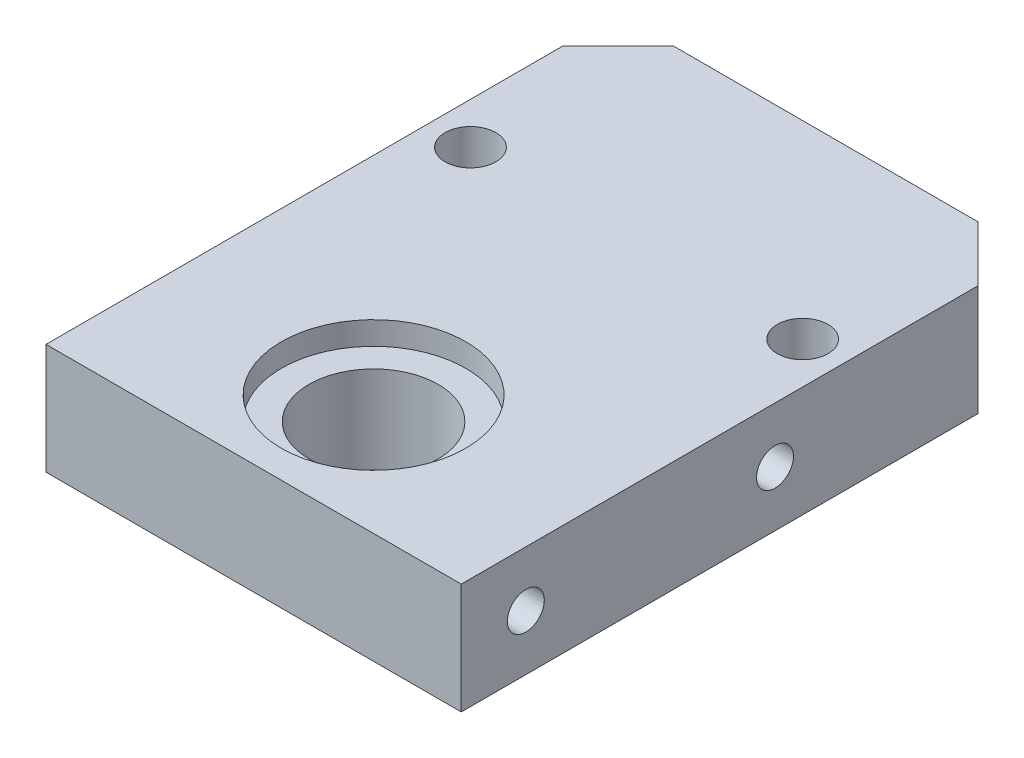
ISO-10303-21;
HEADER;
FILE_DESCRIPTION(('STEP AP214'),'2;1');
FILE_NAME('part.step','',(''),(''),'','','');
FILE_SCHEMA(('AUTOMOTIVE_DESIGN { 1 0 10303 214 1 1 1 1 }'));
ENDSEC;
DATA;
#1=APPLICATION_CONTEXT('core data for automotive mechanical design processes');
#2=APPLICATION_PROTOCOL_DEFINITION('international standard','automotive_design',2000,#1);
#3=PRODUCT_CONTEXT('',#1,'mechanical');
#4=PRODUCT('Part','Part','',(#3));
#5=PRODUCT_RELATED_PRODUCT_CATEGORY('part','',(#4));
#6=PRODUCT_DEFINITION_FORMATION('','',#4);
#7=PRODUCT_DEFINITION_CONTEXT('part definition',#1,'design');
#8=PRODUCT_DEFINITION('design','',#6,#7);
#9=PRODUCT_DEFINITION_SHAPE('','',#8);
#10=(LENGTH_UNIT() NAMED_UNIT(*) SI_UNIT(.MILLI.,.METRE.));
#11=(NAMED_UNIT(*) PLANE_ANGLE_UNIT() SI_UNIT($,.RADIAN.));
#12=(NAMED_UNIT(*) SI_UNIT($,.STERADIAN.) SOLID_ANGLE_UNIT());
#13=UNCERTAINTY_MEASURE_WITH_UNIT(LENGTH_MEASURE(1.E-05),#10,'distance_accuracy_value','');
#14=(GEOMETRIC_REPRESENTATION_CONTEXT(3) GLOBAL_UNCERTAINTY_ASSIGNED_CONTEXT((#13)) GLOBAL_UNIT_ASSIGNED_CONTEXT((#10,
#11,#12)) REPRESENTATION_CONTEXT('',''));
#15=CARTESIAN_POINT('',(0.,0.,0.));
#16=DIRECTION('',(0.,0.,1.));
#17=DIRECTION('',(1.,0.,0.));
#18=AXIS2_PLACEMENT_3D('',#15,#16,#17);
#19=CARTESIAN_POINT('',(0.,0.,18.));
#20=DIRECTION('',(0.,1.,0.));
#21=DIRECTION('',(0.,0.,1.));
#22=AXIS2_PLACEMENT_3D('',#19,#20,#21);
#23=CYLINDRICAL_SURFACE('',#22,7.);
#24=CARTESIAN_POINT('',(0.,0.,18.));
#25=DIRECTION('',(0.,1.,0.));
#26=DIRECTION('',(0.,0.,1.));
#27=AXIS2_PLACEMENT_3D('',#24,#25,#26);
#28=CIRCLE('',#27,7.);
#29=CARTESIAN_POINT('',(0.,0.,25.));
#30=VERTEX_POINT('',#29);
#31=EDGE_CURVE('E117',#30,#30,#28,.T.);
#32=ORIENTED_EDGE('',*,*,#31,.F.);
#33=EDGE_LOOP('',(#32));
#34=FACE_BOUND('',#33,.T.);
#35=CARTESIAN_POINT('',(0.,9.5,18.));
#36=DIRECTION('',(0.,1.,0.));
#37=DIRECTION('',(0.,0.,1.));
#38=AXIS2_PLACEMENT_3D('',#35,#36,#37);
#39=CIRCLE('',#38,7.);
#40=CARTESIAN_POINT('',(0.,9.5,25.));
#41=VERTEX_POINT('',#40);
#42=EDGE_CURVE('E123',#41,#41,#39,.F.);
#43=ORIENTED_EDGE('',*,*,#42,.F.);
#44=EDGE_LOOP('',(#43));
#45=FACE_BOUND('',#44,.T.);
#46=ADVANCED_FACE('F32',(#34,#45),#23,.F.);
#47=CARTESIAN_POINT('',(22.5,12.,-31.));
#48=DIRECTION('',(-1.,0.,0.));
#49=DIRECTION('',(0.,0.,1.));
#50=AXIS2_PLACEMENT_3D('',#47,#48,#49);
#51=PLANE('',#50);
#52=CARTESIAN_POINT('',(22.5,6.,24.));
#53=DIRECTION('',(1.,0.,0.));
#54=DIRECTION('',(0.,0.,-1.));
#55=AXIS2_PLACEMENT_3D('',#52,#53,#54);
#56=CIRCLE('',#55,2.);
#57=CARTESIAN_POINT('',(22.5,6.,22.));
#58=VERTEX_POINT('',#57);
#59=EDGE_CURVE('E186',#58,#58,#56,.T.);
#60=ORIENTED_EDGE('',*,*,#59,.F.);
#61=EDGE_LOOP('',(#60));
#62=FACE_BOUND('',#61,.T.);
#63=CARTESIAN_POINT('',(22.5,6.,-2.99999999999999));
#64=DIRECTION('',(1.,0.,0.));
#65=DIRECTION('',(0.,0.,-1.));
#66=AXIS2_PLACEMENT_3D('',#63,#64,#65);
#67=CIRCLE('',#66,2.);
#68=CARTESIAN_POINT('',(22.5,6.,-5.));
#69=VERTEX_POINT('',#68);
#70=EDGE_CURVE('E180',#69,#69,#67,.T.);
#71=ORIENTED_EDGE('',*,*,#70,.F.);
#72=EDGE_LOOP('',(#71));
#73=FACE_BOUND('',#72,.T.);
#74=DIRECTION('',(0.,0.,-1.));
#75=VECTOR('',#74,1.);
#76=CARTESIAN_POINT('',(22.5,0.,-31.));
#77=LINE('',#76,#75);
#78=CARTESIAN_POINT('',(22.5,0.,31.));
#79=VERTEX_POINT('',#78);
#80=CARTESIAN_POINT('',(22.5,0.,-25.));
#81=VERTEX_POINT('',#80);
#82=EDGE_CURVE('E114',#79,#81,#77,.T.);
#83=ORIENTED_EDGE('',*,*,#82,.T.);
#84=DIRECTION('',(0.,1.,0.));
#85=VECTOR('',#84,1.);
#86=CARTESIAN_POINT('',(22.5,12.,-25.));
#87=LINE('',#86,#85);
#88=CARTESIAN_POINT('',(22.5,12.,-25.));
#89=VERTEX_POINT('',#88);
#90=EDGE_CURVE('E11',#81,#89,#87,.T.);
#91=ORIENTED_EDGE('',*,*,#90,.T.);
#92=DIRECTION('',(0.,0.,-1.));
#93=VECTOR('',#92,1.);
#94=CARTESIAN_POINT('',(22.5,12.,-31.));
#95=LINE('',#94,#93);
#96=CARTESIAN_POINT('',(22.5,12.,31.));
#97=VERTEX_POINT('',#96);
#98=EDGE_CURVE('E121',#97,#89,#95,.T.);
#99=ORIENTED_EDGE('',*,*,#98,.F.);
#100=DIRECTION('',(0.,-1.,0.));
#101=VECTOR('',#100,1.);
#102=CARTESIAN_POINT('',(22.5,12.,31.));
#103=LINE('',#102,#101);
#104=EDGE_CURVE('E106',#97,#79,#103,.T.);
#105=ORIENTED_EDGE('',*,*,#104,.T.);
#106=EDGE_LOOP('',(#83,#91,#99,#105));
#107=FACE_BOUND('',#106,.T.);
#108=ADVANCED_FACE('F146',(#62,#73,#107),#51,.F.);
#109=CARTESIAN_POINT('',(-22.5,12.,-31.));
#110=DIRECTION('',(0.,0.,1.));
#111=DIRECTION('',(1.,0.,0.));
#112=AXIS2_PLACEMENT_3D('',#109,#110,#111);
#113=PLANE('',#112);
#114=DIRECTION('',(-1.,0.,0.));
#115=VECTOR('',#114,1.);
#116=CARTESIAN_POINT('',(-22.5,0.,-31.));
#117=LINE('',#116,#115);
#118=CARTESIAN_POINT('',(16.5,0.,-31.));
#119=VERTEX_POINT('',#118);
#120=CARTESIAN_POINT('',(-16.5,0.,-31.));
#121=VERTEX_POINT('',#120);
#122=EDGE_CURVE('E116',#119,#121,#117,.T.);
#123=ORIENTED_EDGE('',*,*,#122,.T.);
#124=DIRECTION('',(0.,1.,0.));
#125=VECTOR('',#124,1.);
#126=CARTESIAN_POINT('',(-16.5,12.,-31.));
#127=LINE('',#126,#125);
#128=CARTESIAN_POINT('',(-16.5,12.,-31.));
#129=VERTEX_POINT('',#128);
#130=EDGE_CURVE('E53',#121,#129,#127,.T.);
#131=ORIENTED_EDGE('',*,*,#130,.T.);
#132=DIRECTION('',(-1.,0.,0.));
#133=VECTOR('',#132,1.);
#134=CARTESIAN_POINT('',(-22.5,12.,-31.));
#135=LINE('',#134,#133);
#136=CARTESIAN_POINT('',(16.5,12.,-31.));
#137=VERTEX_POINT('',#136);
#138=EDGE_CURVE('E96',#137,#129,#135,.T.);
#139=ORIENTED_EDGE('',*,*,#138,.F.);
#140=DIRECTION('',(0.,-1.,0.));
#141=VECTOR('',#140,1.);
#142=CARTESIAN_POINT('',(16.5,12.,-31.));
#143=LINE('',#142,#141);
#144=EDGE_CURVE('E133',#137,#119,#143,.T.);
#145=ORIENTED_EDGE('',*,*,#144,.T.);
#146=EDGE_LOOP('',(#123,#131,#139,#145));
#147=FACE_BOUND('',#146,.T.);
#148=ADVANCED_FACE('F141',(#147),#113,.F.);
#149=CARTESIAN_POINT('',(-22.5,12.,-31.));
#150=DIRECTION('',(1.,0.,0.));
#151=DIRECTION('',(0.,0.,-1.));
#152=AXIS2_PLACEMENT_3D('',#149,#150,#151);
#153=PLANE('',#152);
#154=CARTESIAN_POINT('',(-22.5,6.,24.));
#155=DIRECTION('',(-1.,0.,0.));
#156=DIRECTION('',(0.,0.,1.));
#157=AXIS2_PLACEMENT_3D('',#154,#155,#156);
#158=CIRCLE('',#157,2.);
#159=CARTESIAN_POINT('',(-22.5,6.,26.));
#160=VERTEX_POINT('',#159);
#161=EDGE_CURVE('E175',#160,#160,#158,.T.);
#162=ORIENTED_EDGE('',*,*,#161,.F.);
#163=EDGE_LOOP('',(#162));
#164=FACE_BOUND('',#163,.T.);
#165=CARTESIAN_POINT('',(-22.5,6.,-3.));
#166=DIRECTION('',(-1.,0.,0.));
#167=DIRECTION('',(0.,0.,1.));
#168=AXIS2_PLACEMENT_3D('',#165,#166,#167);
#169=CIRCLE('',#168,2.);
#170=CARTESIAN_POINT('',(-22.5,6.,-0.999999999999997));
#171=VERTEX_POINT('',#170);
#172=EDGE_CURVE('E168',#171,#171,#169,.T.);
#173=ORIENTED_EDGE('',*,*,#172,.F.);
#174=EDGE_LOOP('',(#173));
#175=FACE_BOUND('',#174,.T.);
#176=DIRECTION('',(0.,0.,1.));
#177=VECTOR('',#176,1.);
#178=CARTESIAN_POINT('',(-22.5,12.,-31.));
#179=LINE('',#178,#177);
#180=CARTESIAN_POINT('',(-22.5,12.,-25.));
#181=VERTEX_POINT('',#180);
#182=CARTESIAN_POINT('',(-22.5,12.,31.));
#183=VERTEX_POINT('',#182);
#184=EDGE_CURVE('E86',#181,#183,#179,.T.);
#185=ORIENTED_EDGE('',*,*,#184,.F.);
#186=DIRECTION('',(0.,-1.,0.));
#187=VECTOR('',#186,1.);
#188=CARTESIAN_POINT('',(-22.5,12.,-25.));
#189=LINE('',#188,#187);
#190=CARTESIAN_POINT('',(-22.5,0.,-25.));
#191=VERTEX_POINT('',#190);
#192=EDGE_CURVE('E105',#181,#191,#189,.T.);
#193=ORIENTED_EDGE('',*,*,#192,.T.);
#194=DIRECTION('',(0.,0.,1.));
#195=VECTOR('',#194,1.);
#196=CARTESIAN_POINT('',(-22.5,0.,-31.));
#197=LINE('',#196,#195);
#198=CARTESIAN_POINT('',(-22.5,0.,31.));
#199=VERTEX_POINT('',#198);
#200=EDGE_CURVE('E102',#191,#199,#197,.T.);
#201=ORIENTED_EDGE('',*,*,#200,.T.);
#202=DIRECTION('',(0.,-1.,0.));
#203=VECTOR('',#202,1.);
#204=CARTESIAN_POINT('',(-22.5,12.,31.));
#205=LINE('',#204,#203);
#206=EDGE_CURVE('E99',#183,#199,#205,.T.);
#207=ORIENTED_EDGE('',*,*,#206,.F.);
#208=EDGE_LOOP('',(#185,#193,#201,#207));
#209=FACE_BOUND('',#208,.T.);
#210=ADVANCED_FACE('F100',(#164,#175,#209),#153,.F.);
#211=CARTESIAN_POINT('',(-22.5,12.,31.));
#212=DIRECTION('',(0.,0.,-1.));
#213=DIRECTION('',(-1.,0.,0.));
#214=AXIS2_PLACEMENT_3D('',#211,#212,#213);
#215=PLANE('',#214);
#216=DIRECTION('',(1.,0.,0.));
#217=VECTOR('',#216,1.);
#218=CARTESIAN_POINT('',(-22.5,0.,31.));
#219=LINE('',#218,#217);
#220=EDGE_CURVE('E120',#199,#79,#219,.T.);
#221=ORIENTED_EDGE('',*,*,#220,.T.);
#222=ORIENTED_EDGE('',*,*,#104,.F.);
#223=DIRECTION('',(1.,0.,0.));
#224=VECTOR('',#223,1.);
#225=CARTESIAN_POINT('',(-22.5,12.,31.));
#226=LINE('',#225,#224);
#227=EDGE_CURVE('E90',#183,#97,#226,.T.);
#228=ORIENTED_EDGE('',*,*,#227,.F.);
#229=ORIENTED_EDGE('',*,*,#206,.T.);
#230=EDGE_LOOP('',(#221,#222,#228,#229));
#231=FACE_BOUND('',#230,.T.);
#232=ADVANCED_FACE('F108',(#231),#215,.F.);
#233=CARTESIAN_POINT('',(0.,12.,0.));
#234=DIRECTION('',(0.,1.,0.));
#235=DIRECTION('',(0.,0.,1.));
#236=AXIS2_PLACEMENT_3D('',#233,#234,#235);
#237=PLANE('',#236);
#238=CARTESIAN_POINT('',(0.,12.,18.));
#239=DIRECTION('',(0.,1.,0.));
#240=DIRECTION('',(0.,0.,1.));
#241=AXIS2_PLACEMENT_3D('',#238,#239,#240);
#242=CIRCLE('',#241,10.);
#243=CARTESIAN_POINT('',(0.,12.,28.));
#244=VERTEX_POINT('',#243);
#245=EDGE_CURVE('E162',#244,#244,#242,.T.);
#246=ORIENTED_EDGE('',*,*,#245,.F.);
#247=EDGE_LOOP('',(#246));
#248=FACE_BOUND('',#247,.T.);
#249=CARTESIAN_POINT('',(-18.,12.,-10.5));
#250=DIRECTION('',(0.,1.,0.));
#251=DIRECTION('',(0.,0.,1.));
#252=AXIS2_PLACEMENT_3D('',#249,#250,#251);
#253=CIRCLE('',#252,2.75);
#254=CARTESIAN_POINT('',(-18.,12.,-7.75));
#255=VERTEX_POINT('',#254);
#256=EDGE_CURVE('E154',#255,#255,#253,.T.);
#257=ORIENTED_EDGE('',*,*,#256,.F.);
#258=EDGE_LOOP('',(#257));
#259=FACE_BOUND('',#258,.T.);
#260=CARTESIAN_POINT('',(18.,12.,-10.5));
#261=DIRECTION('',(0.,1.,0.));
#262=DIRECTION('',(0.,0.,1.));
#263=AXIS2_PLACEMENT_3D('',#260,#261,#262);
#264=CIRCLE('',#263,2.75);
#265=CARTESIAN_POINT('',(18.,12.,-7.75));
#266=VERTEX_POINT('',#265);
#267=EDGE_CURVE('E126',#266,#266,#264,.T.);
#268=ORIENTED_EDGE('',*,*,#267,.F.);
#269=EDGE_LOOP('',(#268));
#270=FACE_BOUND('',#269,.T.);
#271=ORIENTED_EDGE('',*,*,#138,.T.);
#272=DIRECTION('',(0.707106781186549,0.,-0.707106781186546));
#273=VECTOR('',#272,1.);
#274=CARTESIAN_POINT('',(-23.75,12.,-23.7500000000001));
#275=LINE('',#274,#273);
#276=EDGE_CURVE('E40',#129,#181,#275,.F.);
#277=ORIENTED_EDGE('',*,*,#276,.T.);
#278=ORIENTED_EDGE('',*,*,#184,.T.);
#279=ORIENTED_EDGE('',*,*,#227,.T.);
#280=ORIENTED_EDGE('',*,*,#98,.T.);
#281=DIRECTION('',(0.707106781186546,0.,0.707106781186549));
#282=VECTOR('',#281,1.);
#283=CARTESIAN_POINT('',(23.75,12.,-23.7499999999999));
#284=LINE('',#283,#282);
#285=EDGE_CURVE('E137',#89,#137,#284,.F.);
#286=ORIENTED_EDGE('',*,*,#285,.T.);
#287=EDGE_LOOP('',(#271,#277,#278,#279,#280,#286));
#288=FACE_BOUND('',#287,.T.);
#289=ADVANCED_FACE('F88',(#248,#259,#270,#288),#237,.T.);
#290=CARTESIAN_POINT('',(0.,0.,0.));
#291=DIRECTION('',(0.,1.,0.));
#292=DIRECTION('',(0.,0.,1.));
#293=AXIS2_PLACEMENT_3D('',#290,#291,#292);
#294=PLANE('',#293);
#295=ORIENTED_EDGE('',*,*,#31,.T.);
#296=EDGE_LOOP('',(#295));
#297=FACE_BOUND('',#296,.T.);
#298=CARTESIAN_POINT('',(-18.,0.,-10.5));
#299=DIRECTION('',(0.,1.,0.));
#300=DIRECTION('',(0.,0.,1.));
#301=AXIS2_PLACEMENT_3D('',#298,#299,#300);
#302=CIRCLE('',#301,2.75);
#303=CARTESIAN_POINT('',(-18.,0.,-7.75));
#304=VERTEX_POINT('',#303);
#305=EDGE_CURVE('E157',#304,#304,#302,.T.);
#306=ORIENTED_EDGE('',*,*,#305,.T.);
#307=EDGE_LOOP('',(#306));
#308=FACE_BOUND('',#307,.T.);
#309=CARTESIAN_POINT('',(18.,0.,-10.5));
#310=DIRECTION('',(0.,1.,0.));
#311=DIRECTION('',(0.,0.,1.));
#312=AXIS2_PLACEMENT_3D('',#309,#310,#311);
#313=CIRCLE('',#312,2.75);
#314=CARTESIAN_POINT('',(18.,0.,-7.75));
#315=VERTEX_POINT('',#314);
#316=EDGE_CURVE('E151',#315,#315,#313,.T.);
#317=ORIENTED_EDGE('',*,*,#316,.T.);
#318=EDGE_LOOP('',(#317));
#319=FACE_BOUND('',#318,.T.);
#320=ORIENTED_EDGE('',*,*,#200,.F.);
#321=DIRECTION('',(-0.707106781186549,0.,0.707106781186546));
#322=VECTOR('',#321,1.);
#323=CARTESIAN_POINT('',(-22.5,0.,-25.));
#324=LINE('',#323,#322);
#325=EDGE_CURVE('E131',#191,#121,#324,.F.);
#326=ORIENTED_EDGE('',*,*,#325,.T.);
#327=ORIENTED_EDGE('',*,*,#122,.F.);
#328=DIRECTION('',(-0.707106781186546,0.,-0.707106781186549));
#329=VECTOR('',#328,1.);
#330=CARTESIAN_POINT('',(16.5,0.,-31.));
#331=LINE('',#330,#329);
#332=EDGE_CURVE('E129',#119,#81,#331,.F.);
#333=ORIENTED_EDGE('',*,*,#332,.T.);
#334=ORIENTED_EDGE('',*,*,#82,.F.);
#335=ORIENTED_EDGE('',*,*,#220,.F.);
#336=EDGE_LOOP('',(#320,#326,#327,#333,#334,#335));
#337=FACE_BOUND('',#336,.T.);
#338=ADVANCED_FACE('F145',(#297,#308,#319,#337),#294,.F.);
#339=CARTESIAN_POINT('',(18.,0.,-10.5));
#340=DIRECTION('',(0.,1.,0.));
#341=DIRECTION('',(0.,0.,1.));
#342=AXIS2_PLACEMENT_3D('',#339,#340,#341);
#343=CYLINDRICAL_SURFACE('',#342,2.75);
#344=ORIENTED_EDGE('',*,*,#316,.F.);
#345=EDGE_LOOP('',(#344));
#346=FACE_BOUND('',#345,.T.);
#347=ORIENTED_EDGE('',*,*,#267,.T.);
#348=EDGE_LOOP('',(#347));
#349=FACE_BOUND('',#348,.T.);
#350=ADVANCED_FACE('F236',(#346,#349),#343,.F.);
#351=CARTESIAN_POINT('',(-18.,0.,-10.5));
#352=DIRECTION('',(0.,1.,0.));
#353=DIRECTION('',(0.,0.,1.));
#354=AXIS2_PLACEMENT_3D('',#351,#352,#353);
#355=CYLINDRICAL_SURFACE('',#354,2.75);
#356=ORIENTED_EDGE('',*,*,#305,.F.);
#357=EDGE_LOOP('',(#356));
#358=FACE_BOUND('',#357,.T.);
#359=ORIENTED_EDGE('',*,*,#256,.T.);
#360=EDGE_LOOP('',(#359));
#361=FACE_BOUND('',#360,.T.);
#362=ADVANCED_FACE('F232',(#358,#361),#355,.F.);
#363=CARTESIAN_POINT('',(0.,9.5,18.));
#364=DIRECTION('',(0.,1.,0.));
#365=DIRECTION('',(0.,0.,1.));
#366=AXIS2_PLACEMENT_3D('',#363,#364,#365);
#367=PLANE('',#366);
#368=CARTESIAN_POINT('',(0.,9.5,18.));
#369=DIRECTION('',(0.,1.,0.));
#370=DIRECTION('',(0.,0.,1.));
#371=AXIS2_PLACEMENT_3D('',#368,#369,#370);
#372=CIRCLE('',#371,10.);
#373=CARTESIAN_POINT('',(0.,9.5,28.));
#374=VERTEX_POINT('',#373);
#375=EDGE_CURVE('E127',#374,#374,#372,.T.);
#376=ORIENTED_EDGE('',*,*,#375,.T.);
#377=EDGE_LOOP('',(#376));
#378=FACE_BOUND('',#377,.T.);
#379=ORIENTED_EDGE('',*,*,#42,.T.);
#380=EDGE_LOOP('',(#379));
#381=FACE_BOUND('',#380,.T.);
#382=ADVANCED_FACE('F235',(#378,#381),#367,.T.);
#383=CARTESIAN_POINT('',(0.,9.5,18.));
#384=DIRECTION('',(0.,1.,0.));
#385=DIRECTION('',(0.,0.,1.));
#386=AXIS2_PLACEMENT_3D('',#383,#384,#385);
#387=CYLINDRICAL_SURFACE('',#386,10.);
#388=ORIENTED_EDGE('',*,*,#375,.F.);
#389=EDGE_LOOP('',(#388));
#390=FACE_BOUND('',#389,.T.);
#391=ORIENTED_EDGE('',*,*,#245,.T.);
#392=EDGE_LOOP('',(#391));
#393=FACE_BOUND('',#392,.T.);
#394=ADVANCED_FACE('F230',(#390,#393),#387,.F.);
#395=CARTESIAN_POINT('',(-6.50000000000001,6.,-3.));
#396=DIRECTION('',(-1.,0.,0.));
#397=DIRECTION('',(0.,0.,1.));
#398=AXIS2_PLACEMENT_3D('',#395,#396,#397);
#399=CYLINDRICAL_SURFACE('',#398,2.);
#400=CARTESIAN_POINT('',(-6.50000000000001,6.,-3.));
#401=DIRECTION('',(-1.,0.,0.));
#402=DIRECTION('',(0.,0.,1.));
#403=AXIS2_PLACEMENT_3D('',#400,#401,#402);
#404=CIRCLE('',#403,2.);
#405=CARTESIAN_POINT('',(-6.50000000000001,6.,-0.999999999999999));
#406=VERTEX_POINT('',#405);
#407=EDGE_CURVE('E171',#406,#406,#404,.T.);
#408=ORIENTED_EDGE('',*,*,#407,.F.);
#409=EDGE_LOOP('',(#408));
#410=FACE_BOUND('',#409,.T.);
#411=ORIENTED_EDGE('',*,*,#172,.T.);
#412=EDGE_LOOP('',(#411));
#413=FACE_BOUND('',#412,.T.);
#414=ADVANCED_FACE('F301',(#410,#413),#399,.F.);
#415=CARTESIAN_POINT('',(-6.50000000000001,6.,-3.));
#416=DIRECTION('',(-1.,0.,0.));
#417=DIRECTION('',(0.,0.,1.));
#418=AXIS2_PLACEMENT_3D('',#415,#416,#417);
#419=PLANE('',#418);
#420=ORIENTED_EDGE('',*,*,#407,.T.);
#421=EDGE_LOOP('',(#420));
#422=FACE_BOUND('',#421,.T.);
#423=ADVANCED_FACE('F291',(#422),#419,.T.);
#424=CARTESIAN_POINT('',(-6.5,6.,24.));
#425=DIRECTION('',(-1.,0.,0.));
#426=DIRECTION('',(0.,0.,1.));
#427=AXIS2_PLACEMENT_3D('',#424,#425,#426);
#428=CYLINDRICAL_SURFACE('',#427,2.);
#429=CARTESIAN_POINT('',(-6.5,6.,24.));
#430=DIRECTION('',(-1.,0.,0.));
#431=DIRECTION('',(0.,0.,1.));
#432=AXIS2_PLACEMENT_3D('',#429,#430,#431);
#433=CIRCLE('',#432,2.);
#434=CARTESIAN_POINT('',(-6.5,6.,26.));
#435=VERTEX_POINT('',#434);
#436=EDGE_CURVE('E165',#435,#435,#433,.T.);
#437=ORIENTED_EDGE('',*,*,#436,.F.);
#438=EDGE_LOOP('',(#437));
#439=FACE_BOUND('',#438,.T.);
#440=ORIENTED_EDGE('',*,*,#161,.T.);
#441=EDGE_LOOP('',(#440));
#442=FACE_BOUND('',#441,.T.);
#443=ADVANCED_FACE('F217',(#439,#442),#428,.F.);
#444=CARTESIAN_POINT('',(-6.5,6.,24.));
#445=DIRECTION('',(-1.,0.,0.));
#446=DIRECTION('',(0.,0.,1.));
#447=AXIS2_PLACEMENT_3D('',#444,#445,#446);
#448=PLANE('',#447);
#449=ORIENTED_EDGE('',*,*,#436,.T.);
#450=EDGE_LOOP('',(#449));
#451=FACE_BOUND('',#450,.T.);
#452=ADVANCED_FACE('F208',(#451),#448,.T.);
#453=CARTESIAN_POINT('',(6.49999999999999,6.,-2.99999999999999));
#454=DIRECTION('',(1.,0.,0.));
#455=DIRECTION('',(0.,0.,-1.));
#456=AXIS2_PLACEMENT_3D('',#453,#454,#455);
#457=CYLINDRICAL_SURFACE('',#456,2.);
#458=CARTESIAN_POINT('',(6.49999999999999,6.,-2.99999999999999));
#459=DIRECTION('',(1.,0.,0.));
#460=DIRECTION('',(0.,0.,-1.));
#461=AXIS2_PLACEMENT_3D('',#458,#459,#460);
#462=CIRCLE('',#461,2.);
#463=CARTESIAN_POINT('',(6.49999999999999,6.,-4.99999999999999));
#464=VERTEX_POINT('',#463);
#465=EDGE_CURVE('E183',#464,#464,#462,.T.);
#466=ORIENTED_EDGE('',*,*,#465,.F.);
#467=EDGE_LOOP('',(#466));
#468=FACE_BOUND('',#467,.T.);
#469=ORIENTED_EDGE('',*,*,#70,.T.);
#470=EDGE_LOOP('',(#469));
#471=FACE_BOUND('',#470,.T.);
#472=ADVANCED_FACE('F206',(#468,#471),#457,.F.);
#473=CARTESIAN_POINT('',(6.49999999999999,6.,-2.99999999999999));
#474=DIRECTION('',(1.,0.,0.));
#475=DIRECTION('',(0.,0.,-1.));
#476=AXIS2_PLACEMENT_3D('',#473,#474,#475);
#477=PLANE('',#476);
#478=ORIENTED_EDGE('',*,*,#465,.T.);
#479=EDGE_LOOP('',(#478));
#480=FACE_BOUND('',#479,.T.);
#481=ADVANCED_FACE('F197',(#480),#477,.T.);
#482=CARTESIAN_POINT('',(6.5,6.,24.));
#483=DIRECTION('',(1.,0.,0.));
#484=DIRECTION('',(0.,0.,-1.));
#485=AXIS2_PLACEMENT_3D('',#482,#483,#484);
#486=CYLINDRICAL_SURFACE('',#485,2.);
#487=CARTESIAN_POINT('',(6.5,6.,24.));
#488=DIRECTION('',(1.,0.,0.));
#489=DIRECTION('',(0.,0.,-1.));
#490=AXIS2_PLACEMENT_3D('',#487,#488,#489);
#491=CIRCLE('',#490,2.);
#492=CARTESIAN_POINT('',(6.5,6.,22.));
#493=VERTEX_POINT('',#492);
#494=EDGE_CURVE('E172',#493,#493,#491,.T.);
#495=ORIENTED_EDGE('',*,*,#494,.F.);
#496=EDGE_LOOP('',(#495));
#497=FACE_BOUND('',#496,.T.);
#498=ORIENTED_EDGE('',*,*,#59,.T.);
#499=EDGE_LOOP('',(#498));
#500=FACE_BOUND('',#499,.T.);
#501=ADVANCED_FACE('F194',(#497,#500),#486,.F.);
#502=CARTESIAN_POINT('',(6.5,6.,24.));
#503=DIRECTION('',(1.,0.,0.));
#504=DIRECTION('',(0.,0.,-1.));
#505=AXIS2_PLACEMENT_3D('',#502,#503,#504);
#506=PLANE('',#505);
#507=ORIENTED_EDGE('',*,*,#494,.T.);
#508=EDGE_LOOP('',(#507));
#509=FACE_BOUND('',#508,.T.);
#510=ADVANCED_FACE('F192',(#509),#506,.T.);
#511=CARTESIAN_POINT('',(-22.5,12.,-25.));
#512=DIRECTION('',(0.707106781186546,0.,0.707106781186549));
#513=DIRECTION('',(0.,-1.,0.));
#514=AXIS2_PLACEMENT_3D('',#511,#512,#513);
#515=PLANE('',#514);
#516=ORIENTED_EDGE('',*,*,#276,.F.);
#517=ORIENTED_EDGE('',*,*,#130,.F.);
#518=ORIENTED_EDGE('',*,*,#325,.F.);
#519=ORIENTED_EDGE('',*,*,#192,.F.);
#520=EDGE_LOOP('',(#516,#517,#518,#519));
#521=FACE_BOUND('',#520,.T.);
#522=ADVANCED_FACE('F253',(#521),#515,.F.);
#523=CARTESIAN_POINT('',(16.5,12.,-31.));
#524=DIRECTION('',(-0.707106781186549,0.,0.707106781186546));
#525=DIRECTION('',(0.,-1.,0.));
#526=AXIS2_PLACEMENT_3D('',#523,#524,#525);
#527=PLANE('',#526);
#528=ORIENTED_EDGE('',*,*,#285,.F.);
#529=ORIENTED_EDGE('',*,*,#90,.F.);
#530=ORIENTED_EDGE('',*,*,#332,.F.);
#531=ORIENTED_EDGE('',*,*,#144,.F.);
#532=EDGE_LOOP('',(#528,#529,#530,#531));
#533=FACE_BOUND('',#532,.T.);
#534=ADVANCED_FACE('F34',(#533),#527,.F.);
#535=CLOSED_SHELL('',(#46,#108,#148,#210,#232,#289,#338,#350,#362,#382,#394,#414,#423,#443,#452,
#472,#481,#501,#510,#522,#534));
#536=MANIFOLD_SOLID_BREP('B2',#535);
#537=ADVANCED_BREP_SHAPE_REPRESENTATION('',(#18,#536),#14);
#538=SHAPE_DEFINITION_REPRESENTATION(#9,#537);
ENDSEC;
END-ISO-10303-21;
